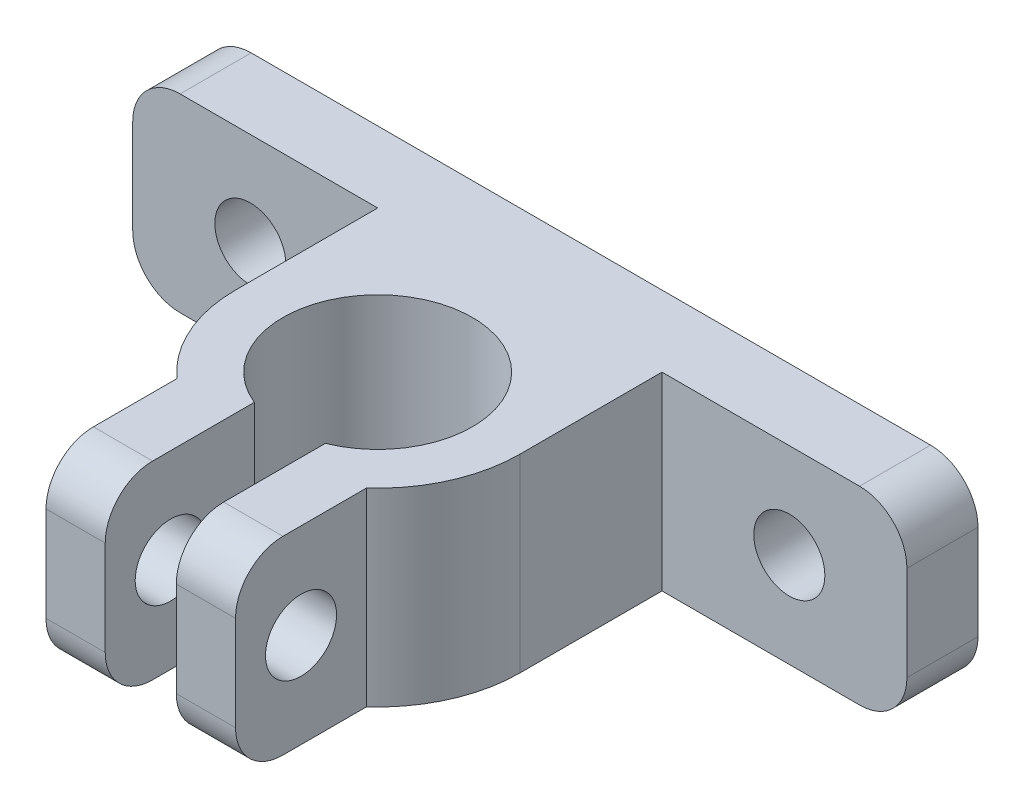
ISO-10303-21;
HEADER;
FILE_DESCRIPTION(('STEP AP214'),'2;1');
FILE_NAME('part.step','',(''),(''),'','','');
FILE_SCHEMA(('AUTOMOTIVE_DESIGN { 1 0 10303 214 1 1 1 1 }'));
ENDSEC;
DATA;
#1=APPLICATION_CONTEXT('core data for automotive mechanical design processes');
#2=APPLICATION_PROTOCOL_DEFINITION('international standard','automotive_design',2000,#1);
#3=PRODUCT_CONTEXT('',#1,'mechanical');
#4=PRODUCT('Part','Part','',(#3));
#5=PRODUCT_RELATED_PRODUCT_CATEGORY('part','',(#4));
#6=PRODUCT_DEFINITION_FORMATION('','',#4);
#7=PRODUCT_DEFINITION_CONTEXT('part definition',#1,'design');
#8=PRODUCT_DEFINITION('design','',#6,#7);
#9=PRODUCT_DEFINITION_SHAPE('','',#8);
#10=(LENGTH_UNIT() NAMED_UNIT(*) SI_UNIT(.MILLI.,.METRE.));
#11=(NAMED_UNIT(*) PLANE_ANGLE_UNIT() SI_UNIT($,.RADIAN.));
#12=(NAMED_UNIT(*) SI_UNIT($,.STERADIAN.) SOLID_ANGLE_UNIT());
#13=UNCERTAINTY_MEASURE_WITH_UNIT(LENGTH_MEASURE(1.E-05),#10,'distance_accuracy_value','');
#14=(GEOMETRIC_REPRESENTATION_CONTEXT(3) GLOBAL_UNCERTAINTY_ASSIGNED_CONTEXT((#13)) GLOBAL_UNIT_ASSIGNED_CONTEXT((#10,
#11,#12)) REPRESENTATION_CONTEXT('',''));
#15=CARTESIAN_POINT('',(0.,0.,0.));
#16=DIRECTION('',(0.,0.,1.));
#17=DIRECTION('',(1.,0.,0.));
#18=AXIS2_PLACEMENT_3D('',#15,#16,#17);
#19=CARTESIAN_POINT('',(0.273302646720342,40.358574689139,16.));
#20=DIRECTION('',(0.,0.,1.));
#21=DIRECTION('',(1.,0.,0.));
#22=AXIS2_PLACEMENT_3D('',#19,#20,#21);
#23=PLANE('',#22);
#24=DIRECTION('',(0.,1.,0.));
#25=VECTOR('',#24,1.);
#26=CARTESIAN_POINT('',(-2.22669735327965,40.358574689139,16.));
#27=LINE('',#26,#25);
#28=CARTESIAN_POINT('',(-2.22669735327965,24.358574689139,16.));
#29=VERTEX_POINT('',#28);
#30=CARTESIAN_POINT('',(-2.22669735327965,28.358574689139,16.));
#31=VERTEX_POINT('',#30);
#32=EDGE_CURVE('E313',#29,#31,#27,.T.);
#33=ORIENTED_EDGE('',*,*,#32,.F.);
#34=DIRECTION('',(-1.,0.,0.));
#35=VECTOR('',#34,1.);
#36=CARTESIAN_POINT('',(0.273302646720342,24.358574689139,16.));
#37=LINE('',#36,#35);
#38=CARTESIAN_POINT('',(0.273302646720342,24.358574689139,16.));
#39=VERTEX_POINT('',#38);
#40=EDGE_CURVE('E68',#29,#39,#37,.F.);
#41=ORIENTED_EDGE('',*,*,#40,.T.);
#42=DIRECTION('',(0.,-1.,0.));
#43=VECTOR('',#42,1.);
#44=CARTESIAN_POINT('',(0.273302646720342,40.358574689139,16.));
#45=LINE('',#44,#43);
#46=CARTESIAN_POINT('',(0.273302646720342,28.358574689139,16.));
#47=VERTEX_POINT('',#46);
#48=EDGE_CURVE('E386',#47,#39,#45,.T.);
#49=ORIENTED_EDGE('',*,*,#48,.F.);
#50=DIRECTION('',(-1.,0.,0.));
#51=VECTOR('',#50,1.);
#52=CARTESIAN_POINT('',(0.273302646720344,28.358574689139,16.));
#53=LINE('',#52,#51);
#54=EDGE_CURVE('E382',#47,#31,#53,.T.);
#55=ORIENTED_EDGE('',*,*,#54,.T.);
#56=EDGE_LOOP('',(#33,#41,#49,#55));
#57=FACE_BOUND('',#56,.T.);
#58=ADVANCED_FACE('F53',(#57),#23,.T.);
#59=CARTESIAN_POINT('',(-3.72669735327962,47.3291374376162,6.));
#60=DIRECTION('',(0.,-1.,0.));
#61=DIRECTION('',(0.,0.,-1.));
#62=AXIS2_PLACEMENT_3D('',#59,#60,#61);
#63=CYLINDRICAL_SURFACE('',#62,6.);
#64=DIRECTION('',(0.,-1.,0.));
#65=VECTOR('',#64,1.);
#66=CARTESIAN_POINT('',(-7.72669735327966,47.3291374376162,10.4721359549995));
#67=LINE('',#66,#65);
#68=CARTESIAN_POINT('',(-7.72669735327966,30.358574689139,10.4721359549995));
#69=VERTEX_POINT('',#68);
#70=CARTESIAN_POINT('',(-7.72669735327966,22.358574689139,10.4721359549995));
#71=VERTEX_POINT('',#70);
#72=EDGE_CURVE('E307',#69,#71,#67,.T.);
#73=ORIENTED_EDGE('',*,*,#72,.F.);
#74=CARTESIAN_POINT('',(-3.72669735327962,30.358574689139,6.));
#75=DIRECTION('',(0.,1.,0.));
#76=DIRECTION('',(-1.,0.,0.));
#77=AXIS2_PLACEMENT_3D('',#74,#75,#76);
#78=CIRCLE('',#77,6.);
#79=CARTESIAN_POINT('',(-9.72669735327963,30.358574689139,6.));
#80=VERTEX_POINT('',#79);
#81=EDGE_CURVE('E254',#69,#80,#78,.F.);
#82=ORIENTED_EDGE('',*,*,#81,.T.);
#83=DIRECTION('',(0.,-1.,0.));
#84=VECTOR('',#83,1.);
#85=CARTESIAN_POINT('',(-9.72669735327963,38.8438560633776,6.));
#86=LINE('',#85,#84);
#87=CARTESIAN_POINT('',(-9.72669735327963,22.358574689139,6.));
#88=VERTEX_POINT('',#87);
#89=EDGE_CURVE('E248',#80,#88,#86,.T.);
#90=ORIENTED_EDGE('',*,*,#89,.T.);
#91=CARTESIAN_POINT('',(-3.72669735327962,22.358574689139,6.));
#92=DIRECTION('',(0.,-1.,0.));
#93=DIRECTION('',(0.,0.,-1.));
#94=AXIS2_PLACEMENT_3D('',#91,#92,#93);
#95=CIRCLE('',#94,6.);
#96=EDGE_CURVE('E245',#71,#88,#95,.T.);
#97=ORIENTED_EDGE('',*,*,#96,.F.);
#98=EDGE_LOOP('',(#73,#82,#90,#97));
#99=FACE_BOUND('',#98,.T.);
#100=ADVANCED_FACE('F505',(#99),#63,.T.);
#101=CARTESIAN_POINT('',(0.,0.,0.));
#102=DIRECTION('',(0.,0.,1.));
#103=DIRECTION('',(1.,0.,0.));
#104=AXIS2_PLACEMENT_3D('',#101,#102,#103);
#105=PLANE('',#104);
#106=CARTESIAN_POINT('',(7.64830264672038,26.358574689139,0.));
#107=DIRECTION('',(0.,0.,1.));
#108=DIRECTION('',(1.,0.,0.));
#109=AXIS2_PLACEMENT_3D('',#106,#107,#108);
#110=CIRCLE('',#109,1.5);
#111=CARTESIAN_POINT('',(9.14830264672038,26.358574689139,0.));
#112=VERTEX_POINT('',#111);
#113=EDGE_CURVE('E265',#112,#112,#110,.T.);
#114=ORIENTED_EDGE('',*,*,#113,.F.);
#115=EDGE_LOOP('',(#114));
#116=FACE_BOUND('',#115,.T.);
#117=DIRECTION('',(1.,0.,0.));
#118=VECTOR('',#117,1.);
#119=CARTESIAN_POINT('',(-20.0653915042754,22.358574689139,0.));
#120=LINE('',#119,#118);
#121=CARTESIAN_POINT('',(2.27330264672038,22.358574689139,0.));
#122=VERTEX_POINT('',#121);
#123=CARTESIAN_POINT('',(10.6119967977161,22.358574689139,0.));
#124=VERTEX_POINT('',#123);
#125=EDGE_CURVE('E303',#122,#124,#120,.T.);
#126=ORIENTED_EDGE('',*,*,#125,.T.);
#127=CARTESIAN_POINT('',(10.6119967977161,24.358574689139,0.));
#128=DIRECTION('',(0.,0.,1.));
#129=DIRECTION('',(1.,0.,0.));
#130=AXIS2_PLACEMENT_3D('',#127,#128,#129);
#131=CIRCLE('',#130,2.);
#132=CARTESIAN_POINT('',(12.6119967977161,24.358574689139,0.));
#133=VERTEX_POINT('',#132);
#134=EDGE_CURVE('E328',#124,#133,#131,.T.);
#135=ORIENTED_EDGE('',*,*,#134,.T.);
#136=DIRECTION('',(0.,1.,0.));
#137=VECTOR('',#136,1.);
#138=CARTESIAN_POINT('',(12.6119967977161,30.358574689139,0.));
#139=LINE('',#138,#137);
#140=CARTESIAN_POINT('',(12.6119967977161,28.358574689139,0.));
#141=VERTEX_POINT('',#140);
#142=EDGE_CURVE('E272',#133,#141,#139,.T.);
#143=ORIENTED_EDGE('',*,*,#142,.T.);
#144=CARTESIAN_POINT('',(10.6119967977161,28.358574689139,0.));
#145=DIRECTION('',(0.,0.,1.));
#146=DIRECTION('',(1.,0.,0.));
#147=AXIS2_PLACEMENT_3D('',#144,#145,#146);
#148=CIRCLE('',#147,2.);
#149=CARTESIAN_POINT('',(10.6119967977161,30.358574689139,0.));
#150=VERTEX_POINT('',#149);
#151=EDGE_CURVE('E326',#141,#150,#148,.T.);
#152=ORIENTED_EDGE('',*,*,#151,.T.);
#153=DIRECTION('',(-1.,0.,0.));
#154=VECTOR('',#153,1.);
#155=CARTESIAN_POINT('',(-20.0653915042754,30.358574689139,0.));
#156=LINE('',#155,#154);
#157=CARTESIAN_POINT('',(2.27330264672038,30.358574689139,0.));
#158=VERTEX_POINT('',#157);
#159=EDGE_CURVE('E298',#150,#158,#156,.T.);
#160=ORIENTED_EDGE('',*,*,#159,.T.);
#161=DIRECTION('',(0.,-1.,0.));
#162=VECTOR('',#161,1.);
#163=CARTESIAN_POINT('',(2.27330264672038,38.8438560633776,0.));
#164=LINE('',#163,#162);
#165=EDGE_CURVE('E257',#158,#122,#164,.T.);
#166=ORIENTED_EDGE('',*,*,#165,.T.);
#167=EDGE_LOOP('',(#126,#135,#143,#152,#160,#166));
#168=FACE_BOUND('',#167,.T.);
#169=ADVANCED_FACE('F464',(#116,#168),#105,.T.);
#170=CARTESIAN_POINT('',(12.6119967977161,30.358574689139,-3.));
#171=DIRECTION('',(1.,0.,0.));
#172=DIRECTION('',(0.,1.,0.));
#173=AXIS2_PLACEMENT_3D('',#170,#171,#172);
#174=PLANE('',#173);
#175=ORIENTED_EDGE('',*,*,#142,.F.);
#176=DIRECTION('',(0.,0.,1.));
#177=VECTOR('',#176,1.);
#178=CARTESIAN_POINT('',(12.6119967977161,24.358574689139,-3.));
#179=LINE('',#178,#177);
#180=CARTESIAN_POINT('',(12.6119967977161,24.358574689139,-3.));
#181=VERTEX_POINT('',#180);
#182=EDGE_CURVE('E333',#133,#181,#179,.F.);
#183=ORIENTED_EDGE('',*,*,#182,.T.);
#184=DIRECTION('',(0.,1.,0.));
#185=VECTOR('',#184,1.);
#186=CARTESIAN_POINT('',(12.6119967977161,30.358574689139,-3.));
#187=LINE('',#186,#185);
#188=CARTESIAN_POINT('',(12.6119967977161,28.358574689139,-3.));
#189=VERTEX_POINT('',#188);
#190=EDGE_CURVE('E281',#181,#189,#187,.T.);
#191=ORIENTED_EDGE('',*,*,#190,.T.);
#192=DIRECTION('',(0.,0.,1.));
#193=VECTOR('',#192,1.);
#194=CARTESIAN_POINT('',(12.6119967977161,28.358574689139,-3.));
#195=LINE('',#194,#193);
#196=EDGE_CURVE('E330',#189,#141,#195,.T.);
#197=ORIENTED_EDGE('',*,*,#196,.T.);
#198=EDGE_LOOP('',(#175,#183,#191,#197));
#199=FACE_BOUND('',#198,.T.);
#200=ADVANCED_FACE('F456',(#199),#174,.T.);
#201=CARTESIAN_POINT('',(-20.0653915042754,22.358574689139,-3.));
#202=DIRECTION('',(0.,-1.,0.));
#203=DIRECTION('',(0.,0.,-1.));
#204=AXIS2_PLACEMENT_3D('',#201,#202,#203);
#205=PLANE('',#204);
#206=DIRECTION('',(0.,0.,-1.));
#207=VECTOR('',#206,1.);
#208=CARTESIAN_POINT('',(-5.22669735327965,22.358574689139,6.));
#209=LINE('',#208,#207);
#210=CARTESIAN_POINT('',(-5.22669735327965,22.358574689139,14.));
#211=VERTEX_POINT('',#210);
#212=CARTESIAN_POINT('',(-5.22669735327965,22.358574689139,9.70809924354782));
#213=VERTEX_POINT('',#212);
#214=EDGE_CURVE('E236',#211,#213,#209,.T.);
#215=ORIENTED_EDGE('',*,*,#214,.F.);
#216=DIRECTION('',(-1.,0.,0.));
#217=VECTOR('',#216,1.);
#218=CARTESIAN_POINT('',(-20.0653915042754,22.358574689139,14.));
#219=LINE('',#218,#217);
#220=CARTESIAN_POINT('',(-7.72669735327966,22.358574689139,14.));
#221=VERTEX_POINT('',#220);
#222=EDGE_CURVE('E375',#211,#221,#219,.T.);
#223=ORIENTED_EDGE('',*,*,#222,.T.);
#224=DIRECTION('',(0.,0.,-1.));
#225=VECTOR('',#224,1.);
#226=CARTESIAN_POINT('',(-7.72669735327966,22.358574689139,10.));
#227=LINE('',#226,#225);
#228=EDGE_CURVE('E394',#221,#71,#227,.T.);
#229=ORIENTED_EDGE('',*,*,#228,.T.);
#230=ORIENTED_EDGE('',*,*,#96,.T.);
#231=DIRECTION('',(0.,0.,-1.));
#232=VECTOR('',#231,1.);
#233=CARTESIAN_POINT('',(-9.72669735327963,22.358574689139,6.));
#234=LINE('',#233,#232);
#235=CARTESIAN_POINT('',(-9.72669735327963,22.358574689139,0.));
#236=VERTEX_POINT('',#235);
#237=EDGE_CURVE('E243',#88,#236,#234,.T.);
#238=ORIENTED_EDGE('',*,*,#237,.T.);
#239=CARTESIAN_POINT('',(-18.0653915042754,22.358574689139,0.));
#240=VERTEX_POINT('',#239);
#241=EDGE_CURVE('E285',#240,#236,#120,.T.);
#242=ORIENTED_EDGE('',*,*,#241,.F.);
#243=DIRECTION('',(0.,0.,1.));
#244=VECTOR('',#243,1.);
#245=CARTESIAN_POINT('',(-18.0653915042754,22.358574689139,-3.));
#246=LINE('',#245,#244);
#247=CARTESIAN_POINT('',(-18.0653915042754,22.358574689139,-3.));
#248=VERTEX_POINT('',#247);
#249=EDGE_CURVE('E316',#240,#248,#246,.F.);
#250=ORIENTED_EDGE('',*,*,#249,.T.);
#251=DIRECTION('',(1.,0.,0.));
#252=VECTOR('',#251,1.);
#253=CARTESIAN_POINT('',(-20.0653915042754,22.358574689139,-3.));
#254=LINE('',#253,#252);
#255=CARTESIAN_POINT('',(10.6119967977161,22.358574689139,-3.));
#256=VERTEX_POINT('',#255);
#257=EDGE_CURVE('E291',#248,#256,#254,.T.);
#258=ORIENTED_EDGE('',*,*,#257,.T.);
#259=DIRECTION('',(0.,0.,1.));
#260=VECTOR('',#259,1.);
#261=CARTESIAN_POINT('',(10.6119967977161,22.358574689139,-3.));
#262=LINE('',#261,#260);
#263=EDGE_CURVE('E323',#256,#124,#262,.T.);
#264=ORIENTED_EDGE('',*,*,#263,.T.);
#265=ORIENTED_EDGE('',*,*,#125,.F.);
#266=DIRECTION('',(0.,0.,-1.));
#267=VECTOR('',#266,1.);
#268=CARTESIAN_POINT('',(2.27330264672038,22.358574689139,6.));
#269=LINE('',#268,#267);
#270=CARTESIAN_POINT('',(2.27330264672038,22.358574689139,6.));
#271=VERTEX_POINT('',#270);
#272=EDGE_CURVE('E258',#271,#122,#269,.T.);
#273=ORIENTED_EDGE('',*,*,#272,.F.);
#274=CARTESIAN_POINT('',(0.273302646720341,22.358574689139,10.4721359549996));
#275=VERTEX_POINT('',#274);
#276=EDGE_CURVE('E251',#271,#275,#95,.T.);
#277=ORIENTED_EDGE('',*,*,#276,.T.);
#278=DIRECTION('',(0.,0.,1.));
#279=VECTOR('',#278,1.);
#280=CARTESIAN_POINT('',(0.273302646720342,22.358574689139,10.));
#281=LINE('',#280,#279);
#282=CARTESIAN_POINT('',(0.273302646720342,22.358574689139,14.));
#283=VERTEX_POINT('',#282);
#284=EDGE_CURVE('E224',#275,#283,#281,.T.);
#285=ORIENTED_EDGE('',*,*,#284,.T.);
#286=DIRECTION('',(-1.,0.,0.));
#287=VECTOR('',#286,1.);
#288=CARTESIAN_POINT('',(-20.0653915042754,22.358574689139,14.));
#289=LINE('',#288,#287);
#290=CARTESIAN_POINT('',(-2.22669735327964,22.358574689139,14.));
#291=VERTEX_POINT('',#290);
#292=EDGE_CURVE('E235',#283,#291,#289,.T.);
#293=ORIENTED_EDGE('',*,*,#292,.T.);
#294=DIRECTION('',(0.,0.,1.));
#295=VECTOR('',#294,1.);
#296=CARTESIAN_POINT('',(-2.2266973532796,22.358574689139,6.));
#297=LINE('',#296,#295);
#298=CARTESIAN_POINT('',(-2.22669735327962,22.358574689139,9.70809924354783));
#299=VERTEX_POINT('',#298);
#300=EDGE_CURVE('E217',#299,#291,#297,.T.);
#301=ORIENTED_EDGE('',*,*,#300,.F.);
#302=CARTESIAN_POINT('',(-3.72669735327962,22.358574689139,6.));
#303=DIRECTION('',(0.,-1.,0.));
#304=DIRECTION('',(0.,0.,-1.));
#305=AXIS2_PLACEMENT_3D('',#302,#303,#304);
#306=CIRCLE('',#305,4.);
#307=EDGE_CURVE('E232',#213,#299,#306,.T.);
#308=ORIENTED_EDGE('',*,*,#307,.F.);
#309=EDGE_LOOP('',(#215,#223,#229,#230,#238,#242,#250,#258,#264,#265,#273,#277,#285,#293,#301,#308));
#310=FACE_BOUND('',#309,.T.);
#311=ADVANCED_FACE('F231',(#310),#205,.T.);
#312=CARTESIAN_POINT('',(-20.0653915042754,30.358574689139,-3.));
#313=DIRECTION('',(-1.,0.,0.));
#314=DIRECTION('',(0.,0.,1.));
#315=AXIS2_PLACEMENT_3D('',#312,#313,#314);
#316=PLANE('',#315);
#317=DIRECTION('',(0.,-1.,0.));
#318=VECTOR('',#317,1.);
#319=CARTESIAN_POINT('',(-20.0653915042754,30.358574689139,-3.));
#320=LINE('',#319,#318);
#321=CARTESIAN_POINT('',(-20.0653915042754,28.358574689139,-3.));
#322=VERTEX_POINT('',#321);
#323=CARTESIAN_POINT('',(-20.0653915042754,24.358574689139,-3.));
#324=VERTEX_POINT('',#323);
#325=EDGE_CURVE('E288',#322,#324,#320,.T.);
#326=ORIENTED_EDGE('',*,*,#325,.T.);
#327=DIRECTION('',(0.,0.,1.));
#328=VECTOR('',#327,1.);
#329=CARTESIAN_POINT('',(-20.0653915042754,24.358574689139,-3.));
#330=LINE('',#329,#328);
#331=CARTESIAN_POINT('',(-20.0653915042754,24.358574689139,0.));
#332=VERTEX_POINT('',#331);
#333=EDGE_CURVE('E350',#324,#332,#330,.T.);
#334=ORIENTED_EDGE('',*,*,#333,.T.);
#335=DIRECTION('',(0.,-1.,0.));
#336=VECTOR('',#335,1.);
#337=CARTESIAN_POINT('',(-20.0653915042754,30.358574689139,0.));
#338=LINE('',#337,#336);
#339=CARTESIAN_POINT('',(-20.0653915042754,28.358574689139,0.));
#340=VERTEX_POINT('',#339);
#341=EDGE_CURVE('E300',#340,#332,#338,.T.);
#342=ORIENTED_EDGE('',*,*,#341,.F.);
#343=DIRECTION('',(0.,0.,1.));
#344=VECTOR('',#343,1.);
#345=CARTESIAN_POINT('',(-20.0653915042754,28.358574689139,-3.));
#346=LINE('',#345,#344);
#347=EDGE_CURVE('E348',#340,#322,#346,.F.);
#348=ORIENTED_EDGE('',*,*,#347,.T.);
#349=EDGE_LOOP('',(#326,#334,#342,#348));
#350=FACE_BOUND('',#349,.T.);
#351=ADVANCED_FACE('F442',(#350),#316,.T.);
#352=CARTESIAN_POINT('',(-20.0653915042754,30.358574689139,-3.));
#353=DIRECTION('',(0.,1.,0.));
#354=DIRECTION('',(-1.,0.,0.));
#355=AXIS2_PLACEMENT_3D('',#352,#353,#354);
#356=PLANE('',#355);
#357=DIRECTION('',(0.,0.,-1.));
#358=VECTOR('',#357,1.);
#359=CARTESIAN_POINT('',(-7.72669735327966,30.358574689139,10.));
#360=LINE('',#359,#358);
#361=CARTESIAN_POINT('',(-7.72669735327966,30.358574689139,14.));
#362=VERTEX_POINT('',#361);
#363=EDGE_CURVE('E401',#362,#69,#360,.T.);
#364=ORIENTED_EDGE('',*,*,#363,.F.);
#365=DIRECTION('',(-1.,0.,0.));
#366=VECTOR('',#365,1.);
#367=CARTESIAN_POINT('',(-20.0653915042754,30.358574689139,14.));
#368=LINE('',#367,#366);
#369=CARTESIAN_POINT('',(-5.22669735327965,30.358574689139,14.));
#370=VERTEX_POINT('',#369);
#371=EDGE_CURVE('E368',#362,#370,#368,.F.);
#372=ORIENTED_EDGE('',*,*,#371,.T.);
#373=DIRECTION('',(0.,0.,-1.));
#374=VECTOR('',#373,1.);
#375=CARTESIAN_POINT('',(-5.22669735327965,30.358574689139,6.));
#376=LINE('',#375,#374);
#377=CARTESIAN_POINT('',(-5.22669735327965,30.358574689139,9.70809924354782));
#378=VERTEX_POINT('',#377);
#379=EDGE_CURVE('E474',#370,#378,#376,.T.);
#380=ORIENTED_EDGE('',*,*,#379,.T.);
#381=CARTESIAN_POINT('',(-3.72669735327962,30.358574689139,6.));
#382=DIRECTION('',(0.,-1.,0.));
#383=DIRECTION('',(0.,0.,-1.));
#384=AXIS2_PLACEMENT_3D('',#381,#382,#383);
#385=CIRCLE('',#384,4.);
#386=CARTESIAN_POINT('',(-2.22669735327962,30.358574689139,9.70809924354783));
#387=VERTEX_POINT('',#386);
#388=EDGE_CURVE('E242',#378,#387,#385,.T.);
#389=ORIENTED_EDGE('',*,*,#388,.T.);
#390=DIRECTION('',(0.,0.,1.));
#391=VECTOR('',#390,1.);
#392=CARTESIAN_POINT('',(-2.2266973532796,30.358574689139,6.));
#393=LINE('',#392,#391);
#394=CARTESIAN_POINT('',(-2.22669735327964,30.358574689139,14.));
#395=VERTEX_POINT('',#394);
#396=EDGE_CURVE('E219',#387,#395,#393,.T.);
#397=ORIENTED_EDGE('',*,*,#396,.T.);
#398=DIRECTION('',(-1.,0.,0.));
#399=VECTOR('',#398,1.);
#400=CARTESIAN_POINT('',(-20.0653915042754,30.358574689139,14.));
#401=LINE('',#400,#399);
#402=CARTESIAN_POINT('',(0.273302646720342,30.358574689139,14.));
#403=VERTEX_POINT('',#402);
#404=EDGE_CURVE('E366',#395,#403,#401,.F.);
#405=ORIENTED_EDGE('',*,*,#404,.T.);
#406=DIRECTION('',(0.,0.,1.));
#407=VECTOR('',#406,1.);
#408=CARTESIAN_POINT('',(0.273302646720342,30.358574689139,10.));
#409=LINE('',#408,#407);
#410=CARTESIAN_POINT('',(0.273302646720342,30.358574689139,10.4721359549996));
#411=VERTEX_POINT('',#410);
#412=EDGE_CURVE('E399',#411,#403,#409,.T.);
#413=ORIENTED_EDGE('',*,*,#412,.F.);
#414=CARTESIAN_POINT('',(2.27330264672038,30.358574689139,6.));
#415=VERTEX_POINT('',#414);
#416=EDGE_CURVE('E255',#415,#411,#78,.F.);
#417=ORIENTED_EDGE('',*,*,#416,.F.);
#418=DIRECTION('',(0.,0.,-1.));
#419=VECTOR('',#418,1.);
#420=CARTESIAN_POINT('',(2.27330264672038,30.358574689139,6.));
#421=LINE('',#420,#419);
#422=EDGE_CURVE('E261',#415,#158,#421,.T.);
#423=ORIENTED_EDGE('',*,*,#422,.T.);
#424=ORIENTED_EDGE('',*,*,#159,.F.);
#425=DIRECTION('',(0.,0.,1.));
#426=VECTOR('',#425,1.);
#427=CARTESIAN_POINT('',(10.6119967977161,30.358574689139,-3.));
#428=LINE('',#427,#426);
#429=CARTESIAN_POINT('',(10.6119967977161,30.358574689139,-3.));
#430=VERTEX_POINT('',#429);
#431=EDGE_CURVE('E346',#150,#430,#428,.F.);
#432=ORIENTED_EDGE('',*,*,#431,.T.);
#433=DIRECTION('',(-1.,0.,0.));
#434=VECTOR('',#433,1.);
#435=CARTESIAN_POINT('',(-20.0653915042754,30.358574689139,-3.));
#436=LINE('',#435,#434);
#437=CARTESIAN_POINT('',(-18.0653915042754,30.358574689139,-3.));
#438=VERTEX_POINT('',#437);
#439=EDGE_CURVE('E284',#430,#438,#436,.T.);
#440=ORIENTED_EDGE('',*,*,#439,.T.);
#441=DIRECTION('',(0.,0.,1.));
#442=VECTOR('',#441,1.);
#443=CARTESIAN_POINT('',(-18.0653915042754,30.358574689139,-3.));
#444=LINE('',#443,#442);
#445=CARTESIAN_POINT('',(-18.0653915042754,30.358574689139,0.));
#446=VERTEX_POINT('',#445);
#447=EDGE_CURVE('E343',#438,#446,#444,.T.);
#448=ORIENTED_EDGE('',*,*,#447,.T.);
#449=CARTESIAN_POINT('',(-9.72669735327963,30.358574689139,0.));
#450=VERTEX_POINT('',#449);
#451=EDGE_CURVE('E297',#450,#446,#156,.T.);
#452=ORIENTED_EDGE('',*,*,#451,.F.);
#453=DIRECTION('',(0.,0.,-1.));
#454=VECTOR('',#453,1.);
#455=CARTESIAN_POINT('',(-9.72669735327963,30.358574689139,6.));
#456=LINE('',#455,#454);
#457=EDGE_CURVE('E409',#80,#450,#456,.T.);
#458=ORIENTED_EDGE('',*,*,#457,.F.);
#459=ORIENTED_EDGE('',*,*,#81,.F.);
#460=EDGE_LOOP('',(#364,#372,#380,#389,#397,#405,#413,#417,#423,#424,#432,#440,#448,#452,#458,#459));
#461=FACE_BOUND('',#460,.T.);
#462=ADVANCED_FACE('F422',(#461),#356,.T.);
#463=CARTESIAN_POINT('',(0.,0.,-3.));
#464=DIRECTION('',(0.,0.,1.));
#465=DIRECTION('',(1.,0.,0.));
#466=AXIS2_PLACEMENT_3D('',#463,#464,#465);
#467=PLANE('',#466);
#468=CARTESIAN_POINT('',(-15.1016973532796,26.358574689139,-3.));
#469=DIRECTION('',(0.,0.,1.));
#470=DIRECTION('',(1.,0.,0.));
#471=AXIS2_PLACEMENT_3D('',#468,#469,#470);
#472=CIRCLE('',#471,1.5);
#473=CARTESIAN_POINT('',(-13.6016973532796,26.358574689139,-3.));
#474=VERTEX_POINT('',#473);
#475=EDGE_CURVE('E269',#474,#474,#472,.T.);
#476=ORIENTED_EDGE('',*,*,#475,.T.);
#477=EDGE_LOOP('',(#476));
#478=FACE_BOUND('',#477,.T.);
#479=CARTESIAN_POINT('',(7.64830264672038,26.358574689139,-3.));
#480=DIRECTION('',(0.,0.,1.));
#481=DIRECTION('',(1.,0.,0.));
#482=AXIS2_PLACEMENT_3D('',#479,#480,#481);
#483=CIRCLE('',#482,1.5);
#484=CARTESIAN_POINT('',(9.14830264672038,26.358574689139,-3.));
#485=VERTEX_POINT('',#484);
#486=EDGE_CURVE('E276',#485,#485,#483,.T.);
#487=ORIENTED_EDGE('',*,*,#486,.T.);
#488=EDGE_LOOP('',(#487));
#489=FACE_BOUND('',#488,.T.);
#490=ORIENTED_EDGE('',*,*,#190,.F.);
#491=CARTESIAN_POINT('',(10.6119967977161,24.358574689139,-3.));
#492=DIRECTION('',(0.,0.,1.));
#493=DIRECTION('',(1.,0.,0.));
#494=AXIS2_PLACEMENT_3D('',#491,#492,#493);
#495=CIRCLE('',#494,2.);
#496=EDGE_CURVE('E341',#181,#256,#495,.F.);
#497=ORIENTED_EDGE('',*,*,#496,.T.);
#498=ORIENTED_EDGE('',*,*,#257,.F.);
#499=CARTESIAN_POINT('',(-18.0653915042754,24.358574689139,-3.));
#500=DIRECTION('',(0.,0.,1.));
#501=DIRECTION('',(1.,0.,0.));
#502=AXIS2_PLACEMENT_3D('',#499,#500,#501);
#503=CIRCLE('',#502,2.);
#504=EDGE_CURVE('E337',#248,#324,#503,.F.);
#505=ORIENTED_EDGE('',*,*,#504,.T.);
#506=ORIENTED_EDGE('',*,*,#325,.F.);
#507=CARTESIAN_POINT('',(-18.0653915042754,28.358574689139,-3.));
#508=DIRECTION('',(0.,0.,1.));
#509=DIRECTION('',(1.,0.,0.));
#510=AXIS2_PLACEMENT_3D('',#507,#508,#509);
#511=CIRCLE('',#510,2.);
#512=EDGE_CURVE('E335',#322,#438,#511,.F.);
#513=ORIENTED_EDGE('',*,*,#512,.T.);
#514=ORIENTED_EDGE('',*,*,#439,.F.);
#515=CARTESIAN_POINT('',(10.6119967977161,28.358574689139,-3.));
#516=DIRECTION('',(0.,0.,1.));
#517=DIRECTION('',(1.,0.,0.));
#518=AXIS2_PLACEMENT_3D('',#515,#516,#517);
#519=CIRCLE('',#518,2.);
#520=EDGE_CURVE('E339',#430,#189,#519,.F.);
#521=ORIENTED_EDGE('',*,*,#520,.T.);
#522=EDGE_LOOP('',(#490,#497,#498,#505,#506,#513,#514,#521));
#523=FACE_BOUND('',#522,.T.);
#524=ADVANCED_FACE('F439',(#478,#489,#523),#467,.F.);
#525=ORIENTED_EDGE('',*,*,#341,.T.);
#526=CARTESIAN_POINT('',(-18.0653915042754,24.358574689139,0.));
#527=DIRECTION('',(0.,0.,1.));
#528=DIRECTION('',(1.,0.,0.));
#529=AXIS2_PLACEMENT_3D('',#526,#527,#528);
#530=CIRCLE('',#529,2.);
#531=EDGE_CURVE('E355',#332,#240,#530,.T.);
#532=ORIENTED_EDGE('',*,*,#531,.T.);
#533=ORIENTED_EDGE('',*,*,#241,.T.);
#534=DIRECTION('',(0.,-1.,0.));
#535=VECTOR('',#534,1.);
#536=CARTESIAN_POINT('',(-9.72669735327963,38.8438560633776,0.));
#537=LINE('',#536,#535);
#538=EDGE_CURVE('E406',#450,#236,#537,.T.);
#539=ORIENTED_EDGE('',*,*,#538,.F.);
#540=ORIENTED_EDGE('',*,*,#451,.T.);
#541=CARTESIAN_POINT('',(-18.0653915042754,28.358574689139,0.));
#542=DIRECTION('',(0.,0.,1.));
#543=DIRECTION('',(1.,0.,0.));
#544=AXIS2_PLACEMENT_3D('',#541,#542,#543);
#545=CIRCLE('',#544,2.);
#546=EDGE_CURVE('E353',#446,#340,#545,.T.);
#547=ORIENTED_EDGE('',*,*,#546,.T.);
#548=EDGE_LOOP('',(#525,#532,#533,#539,#540,#547));
#549=FACE_BOUND('',#548,.T.);
#550=CARTESIAN_POINT('',(-15.1016973532796,26.358574689139,0.));
#551=DIRECTION('',(0.,0.,1.));
#552=DIRECTION('',(1.,0.,0.));
#553=AXIS2_PLACEMENT_3D('',#550,#551,#552);
#554=CIRCLE('',#553,1.5);
#555=CARTESIAN_POINT('',(-13.6016973532796,26.358574689139,0.));
#556=VERTEX_POINT('',#555);
#557=EDGE_CURVE('E273',#556,#556,#554,.T.);
#558=ORIENTED_EDGE('',*,*,#557,.F.);
#559=EDGE_LOOP('',(#558));
#560=FACE_BOUND('',#559,.T.);
#561=ADVANCED_FACE('F426',(#549,#560),#105,.T.);
#562=CARTESIAN_POINT('',(7.64830264672038,26.358574689139,-3.));
#563=DIRECTION('',(0.,0.,1.));
#564=DIRECTION('',(1.,0.,0.));
#565=AXIS2_PLACEMENT_3D('',#562,#563,#564);
#566=CYLINDRICAL_SURFACE('',#565,1.5);
#567=ORIENTED_EDGE('',*,*,#486,.F.);
#568=EDGE_LOOP('',(#567));
#569=FACE_BOUND('',#568,.T.);
#570=ORIENTED_EDGE('',*,*,#113,.T.);
#571=EDGE_LOOP('',(#570));
#572=FACE_BOUND('',#571,.T.);
#573=ADVANCED_FACE('F563',(#569,#572),#566,.F.);
#574=CARTESIAN_POINT('',(-15.1016973532796,26.358574689139,-3.));
#575=DIRECTION('',(0.,0.,1.));
#576=DIRECTION('',(1.,0.,0.));
#577=AXIS2_PLACEMENT_3D('',#574,#575,#576);
#578=CYLINDRICAL_SURFACE('',#577,1.5);
#579=ORIENTED_EDGE('',*,*,#475,.F.);
#580=EDGE_LOOP('',(#579));
#581=FACE_BOUND('',#580,.T.);
#582=ORIENTED_EDGE('',*,*,#557,.T.);
#583=EDGE_LOOP('',(#582));
#584=FACE_BOUND('',#583,.T.);
#585=ADVANCED_FACE('F569',(#581,#584),#578,.F.);
#586=CARTESIAN_POINT('',(2.27330264672038,38.8438560633776,6.));
#587=DIRECTION('',(-1.,0.,0.));
#588=DIRECTION('',(0.,0.,1.));
#589=AXIS2_PLACEMENT_3D('',#586,#587,#588);
#590=PLANE('',#589);
#591=ORIENTED_EDGE('',*,*,#422,.F.);
#592=DIRECTION('',(0.,-1.,0.));
#593=VECTOR('',#592,1.);
#594=CARTESIAN_POINT('',(2.27330264672038,38.8438560633776,6.));
#595=LINE('',#594,#593);
#596=EDGE_CURVE('E262',#415,#271,#595,.T.);
#597=ORIENTED_EDGE('',*,*,#596,.T.);
#598=ORIENTED_EDGE('',*,*,#272,.T.);
#599=ORIENTED_EDGE('',*,*,#165,.F.);
#600=EDGE_LOOP('',(#591,#597,#598,#599));
#601=FACE_BOUND('',#600,.T.);
#602=ADVANCED_FACE('F468',(#601),#590,.F.);
#603=DIRECTION('',(0.,-1.,0.));
#604=VECTOR('',#603,1.);
#605=CARTESIAN_POINT('',(0.273302646720341,47.3291374376162,10.4721359549996));
#606=LINE('',#605,#604);
#607=EDGE_CURVE('E294',#275,#411,#606,.F.);
#608=ORIENTED_EDGE('',*,*,#607,.F.);
#609=ORIENTED_EDGE('',*,*,#276,.F.);
#610=ORIENTED_EDGE('',*,*,#596,.F.);
#611=ORIENTED_EDGE('',*,*,#416,.T.);
#612=EDGE_LOOP('',(#608,#609,#610,#611));
#613=FACE_BOUND('',#612,.T.);
#614=ADVANCED_FACE('F472',(#613),#63,.T.);
#615=CARTESIAN_POINT('',(-3.72669735327962,30.358574689139,6.));
#616=DIRECTION('',(0.,-1.,0.));
#617=DIRECTION('',(0.,0.,-1.));
#618=AXIS2_PLACEMENT_3D('',#615,#616,#617);
#619=CYLINDRICAL_SURFACE('',#618,4.);
#620=ORIENTED_EDGE('',*,*,#307,.T.);
#621=DIRECTION('',(0.,-1.,0.));
#622=VECTOR('',#621,1.);
#623=CARTESIAN_POINT('',(-2.22669735327962,30.358574689139,9.70809924354783));
#624=LINE('',#623,#622);
#625=EDGE_CURVE('E214',#299,#387,#624,.F.);
#626=ORIENTED_EDGE('',*,*,#625,.T.);
#627=ORIENTED_EDGE('',*,*,#388,.F.);
#628=DIRECTION('',(0.,-1.,0.));
#629=VECTOR('',#628,1.);
#630=CARTESIAN_POINT('',(-5.22669735327965,30.358574689139,9.70809924354782));
#631=LINE('',#630,#629);
#632=EDGE_CURVE('E225',#378,#213,#631,.T.);
#633=ORIENTED_EDGE('',*,*,#632,.T.);
#634=EDGE_LOOP('',(#620,#626,#627,#633));
#635=FACE_BOUND('',#634,.T.);
#636=ADVANCED_FACE('F240',(#635),#619,.F.);
#637=CARTESIAN_POINT('',(-9.72669735327963,38.8438560633776,6.));
#638=DIRECTION('',(-1.,0.,0.));
#639=DIRECTION('',(0.,0.,1.));
#640=AXIS2_PLACEMENT_3D('',#637,#638,#639);
#641=PLANE('',#640);
#642=ORIENTED_EDGE('',*,*,#89,.F.);
#643=ORIENTED_EDGE('',*,*,#457,.T.);
#644=ORIENTED_EDGE('',*,*,#538,.T.);
#645=ORIENTED_EDGE('',*,*,#237,.F.);
#646=EDGE_LOOP('',(#642,#643,#644,#645));
#647=FACE_BOUND('',#646,.T.);
#648=ADVANCED_FACE('F416',(#647),#641,.T.);
#649=DIRECTION('',(0.,-1.,0.));
#650=VECTOR('',#649,1.);
#651=CARTESIAN_POINT('',(-5.22669735327965,40.358574689139,16.));
#652=LINE('',#651,#650);
#653=CARTESIAN_POINT('',(-5.22669735327965,28.358574689139,16.));
#654=VERTEX_POINT('',#653);
#655=CARTESIAN_POINT('',(-5.22669735327965,24.358574689139,16.));
#656=VERTEX_POINT('',#655);
#657=EDGE_CURVE('E310',#654,#656,#652,.T.);
#658=ORIENTED_EDGE('',*,*,#657,.F.);
#659=DIRECTION('',(-1.,0.,0.));
#660=VECTOR('',#659,1.);
#661=CARTESIAN_POINT('',(0.273302646720344,28.358574689139,16.));
#662=LINE('',#661,#660);
#663=CARTESIAN_POINT('',(-7.72669735327966,28.358574689139,16.));
#664=VERTEX_POINT('',#663);
#665=EDGE_CURVE('E359',#654,#664,#662,.T.);
#666=ORIENTED_EDGE('',*,*,#665,.T.);
#667=DIRECTION('',(0.,-1.,0.));
#668=VECTOR('',#667,1.);
#669=CARTESIAN_POINT('',(-7.72669735327966,40.358574689139,16.));
#670=LINE('',#669,#668);
#671=CARTESIAN_POINT('',(-7.72669735327966,24.358574689139,16.));
#672=VERTEX_POINT('',#671);
#673=EDGE_CURVE('E396',#664,#672,#670,.T.);
#674=ORIENTED_EDGE('',*,*,#673,.T.);
#675=DIRECTION('',(-1.,0.,0.));
#676=VECTOR('',#675,1.);
#677=CARTESIAN_POINT('',(0.273302646720342,24.358574689139,16.));
#678=LINE('',#677,#676);
#679=EDGE_CURVE('E357',#672,#656,#678,.F.);
#680=ORIENTED_EDGE('',*,*,#679,.T.);
#681=EDGE_LOOP('',(#658,#666,#674,#680));
#682=FACE_BOUND('',#681,.T.);
#683=ADVANCED_FACE('F500',(#682),#23,.T.);
#684=CARTESIAN_POINT('',(-7.72669735327966,40.358574689139,10.));
#685=DIRECTION('',(-1.,0.,0.));
#686=DIRECTION('',(0.,0.,1.));
#687=AXIS2_PLACEMENT_3D('',#684,#685,#686);
#688=PLANE('',#687);
#689=CARTESIAN_POINT('',(-7.72669735327966,26.358574689139,13.2360679774998));
#690=DIRECTION('',(-1.,0.,0.));
#691=DIRECTION('',(0.,0.,1.));
#692=AXIS2_PLACEMENT_3D('',#689,#690,#691);
#693=CIRCLE('',#692,1.5);
#694=CARTESIAN_POINT('',(-7.72669735327966,26.358574689139,14.7360679774998));
#695=VERTEX_POINT('',#694);
#696=EDGE_CURVE('E237',#695,#695,#693,.T.);
#697=ORIENTED_EDGE('',*,*,#696,.F.);
#698=EDGE_LOOP('',(#697));
#699=FACE_BOUND('',#698,.T.);
#700=ORIENTED_EDGE('',*,*,#673,.F.);
#701=CARTESIAN_POINT('',(-7.72669735327966,28.358574689139,14.));
#702=DIRECTION('',(-1.,0.,0.));
#703=DIRECTION('',(0.,0.,1.));
#704=AXIS2_PLACEMENT_3D('',#701,#702,#703);
#705=CIRCLE('',#704,2.);
#706=EDGE_CURVE('E364',#664,#362,#705,.T.);
#707=ORIENTED_EDGE('',*,*,#706,.T.);
#708=ORIENTED_EDGE('',*,*,#363,.T.);
#709=ORIENTED_EDGE('',*,*,#72,.T.);
#710=ORIENTED_EDGE('',*,*,#228,.F.);
#711=CARTESIAN_POINT('',(-7.72669735327966,24.358574689139,14.));
#712=DIRECTION('',(-1.,0.,0.));
#713=DIRECTION('',(0.,0.,1.));
#714=AXIS2_PLACEMENT_3D('',#711,#712,#713);
#715=CIRCLE('',#714,2.);
#716=EDGE_CURVE('E362',#221,#672,#715,.T.);
#717=ORIENTED_EDGE('',*,*,#716,.T.);
#718=EDGE_LOOP('',(#700,#707,#708,#709,#710,#717));
#719=FACE_BOUND('',#718,.T.);
#720=ADVANCED_FACE('F492',(#699,#719),#688,.T.);
#721=CARTESIAN_POINT('',(0.273302646720342,40.358574689139,10.));
#722=DIRECTION('',(1.,0.,0.));
#723=DIRECTION('',(0.,0.,-1.));
#724=AXIS2_PLACEMENT_3D('',#721,#722,#723);
#725=PLANE('',#724);
#726=CARTESIAN_POINT('',(0.27330264672034,26.358574689139,13.2360679774998));
#727=DIRECTION('',(1.,0.,0.));
#728=DIRECTION('',(0.,0.,-1.));
#729=AXIS2_PLACEMENT_3D('',#726,#727,#728);
#730=CIRCLE('',#729,1.5);
#731=CARTESIAN_POINT('',(0.27330264672034,26.358574689139,11.7360679774998));
#732=VERTEX_POINT('',#731);
#733=EDGE_CURVE('E321',#732,#732,#730,.T.);
#734=ORIENTED_EDGE('',*,*,#733,.F.);
#735=EDGE_LOOP('',(#734));
#736=FACE_BOUND('',#735,.T.);
#737=ORIENTED_EDGE('',*,*,#48,.T.);
#738=CARTESIAN_POINT('',(0.27330264672034,24.358574689139,14.));
#739=DIRECTION('',(1.,0.,0.));
#740=DIRECTION('',(0.,0.,-1.));
#741=AXIS2_PLACEMENT_3D('',#738,#739,#740);
#742=CIRCLE('',#741,2.);
#743=EDGE_CURVE('E12',#39,#283,#742,.T.);
#744=ORIENTED_EDGE('',*,*,#743,.T.);
#745=ORIENTED_EDGE('',*,*,#284,.F.);
#746=ORIENTED_EDGE('',*,*,#607,.T.);
#747=ORIENTED_EDGE('',*,*,#412,.T.);
#748=CARTESIAN_POINT('',(0.273302646720342,28.358574689139,14.));
#749=DIRECTION('',(1.,0.,0.));
#750=DIRECTION('',(0.,0.,-1.));
#751=AXIS2_PLACEMENT_3D('',#748,#749,#750);
#752=CIRCLE('',#751,2.);
#753=EDGE_CURVE('E61',#403,#47,#752,.T.);
#754=ORIENTED_EDGE('',*,*,#753,.T.);
#755=EDGE_LOOP('',(#737,#744,#745,#746,#747,#754));
#756=FACE_BOUND('',#755,.T.);
#757=ADVANCED_FACE('F392',(#736,#756),#725,.T.);
#758=CARTESIAN_POINT('',(-5.22669735327965,30.358574689139,6.));
#759=DIRECTION('',(-1.,0.,0.));
#760=DIRECTION('',(0.,0.,1.));
#761=AXIS2_PLACEMENT_3D('',#758,#759,#760);
#762=PLANE('',#761);
#763=CARTESIAN_POINT('',(-5.22669735327965,26.358574689139,13.2360679774998));
#764=DIRECTION('',(-1.,0.,0.));
#765=DIRECTION('',(0.,0.,1.));
#766=AXIS2_PLACEMENT_3D('',#763,#764,#765);
#767=CIRCLE('',#766,1.5);
#768=CARTESIAN_POINT('',(-5.22669735327965,26.358574689139,14.7360679774998));
#769=VERTEX_POINT('',#768);
#770=EDGE_CURVE('E320',#769,#769,#767,.T.);
#771=ORIENTED_EDGE('',*,*,#770,.T.);
#772=EDGE_LOOP('',(#771));
#773=FACE_BOUND('',#772,.T.);
#774=ORIENTED_EDGE('',*,*,#379,.F.);
#775=CARTESIAN_POINT('',(-5.22669735327965,28.358574689139,14.));
#776=DIRECTION('',(-1.,0.,0.));
#777=DIRECTION('',(0.,0.,1.));
#778=AXIS2_PLACEMENT_3D('',#775,#776,#777);
#779=CIRCLE('',#778,2.);
#780=EDGE_CURVE('E372',#370,#654,#779,.F.);
#781=ORIENTED_EDGE('',*,*,#780,.T.);
#782=ORIENTED_EDGE('',*,*,#657,.T.);
#783=CARTESIAN_POINT('',(-5.22669735327965,24.358574689139,14.));
#784=DIRECTION('',(-1.,0.,0.));
#785=DIRECTION('',(0.,0.,1.));
#786=AXIS2_PLACEMENT_3D('',#783,#784,#785);
#787=CIRCLE('',#786,2.);
#788=EDGE_CURVE('E370',#656,#211,#787,.F.);
#789=ORIENTED_EDGE('',*,*,#788,.T.);
#790=ORIENTED_EDGE('',*,*,#214,.T.);
#791=ORIENTED_EDGE('',*,*,#632,.F.);
#792=EDGE_LOOP('',(#774,#781,#782,#789,#790,#791));
#793=FACE_BOUND('',#792,.T.);
#794=ADVANCED_FACE('F491',(#773,#793),#762,.F.);
#795=CARTESIAN_POINT('',(-2.2266973532796,30.358574689139,6.));
#796=DIRECTION('',(1.,0.,0.));
#797=DIRECTION('',(0.,0.,-1.));
#798=AXIS2_PLACEMENT_3D('',#795,#796,#797);
#799=PLANE('',#798);
#800=CARTESIAN_POINT('',(-2.22669735327963,26.358574689139,13.2360679774998));
#801=DIRECTION('',(1.,0.,0.));
#802=DIRECTION('',(0.,0.,-1.));
#803=AXIS2_PLACEMENT_3D('',#800,#801,#802);
#804=CIRCLE('',#803,1.5);
#805=CARTESIAN_POINT('',(-2.22669735327963,26.358574689139,11.7360679774998));
#806=VERTEX_POINT('',#805);
#807=EDGE_CURVE('E317',#806,#806,#804,.T.);
#808=ORIENTED_EDGE('',*,*,#807,.T.);
#809=EDGE_LOOP('',(#808));
#810=FACE_BOUND('',#809,.T.);
#811=ORIENTED_EDGE('',*,*,#300,.T.);
#812=CARTESIAN_POINT('',(-2.22669735327964,24.358574689139,14.));
#813=DIRECTION('',(1.,0.,0.));
#814=DIRECTION('',(0.,0.,-1.));
#815=AXIS2_PLACEMENT_3D('',#812,#813,#814);
#816=CIRCLE('',#815,2.);
#817=EDGE_CURVE('E380',#291,#29,#816,.F.);
#818=ORIENTED_EDGE('',*,*,#817,.T.);
#819=ORIENTED_EDGE('',*,*,#32,.T.);
#820=CARTESIAN_POINT('',(-2.22669735327964,28.358574689139,14.));
#821=DIRECTION('',(1.,0.,0.));
#822=DIRECTION('',(0.,0.,-1.));
#823=AXIS2_PLACEMENT_3D('',#820,#821,#822);
#824=CIRCLE('',#823,2.);
#825=EDGE_CURVE('E378',#31,#395,#824,.F.);
#826=ORIENTED_EDGE('',*,*,#825,.T.);
#827=ORIENTED_EDGE('',*,*,#396,.F.);
#828=ORIENTED_EDGE('',*,*,#625,.F.);
#829=EDGE_LOOP('',(#811,#818,#819,#826,#827,#828));
#830=FACE_BOUND('',#829,.T.);
#831=ADVANCED_FACE('F216',(#810,#830),#799,.F.);
#832=CARTESIAN_POINT('',(-20.0653915042754,26.358574689139,13.2360679774998));
#833=DIRECTION('',(1.,0.,0.));
#834=DIRECTION('',(0.,0.,-1.));
#835=AXIS2_PLACEMENT_3D('',#832,#833,#834);
#836=CYLINDRICAL_SURFACE('',#835,1.5);
#837=ORIENTED_EDGE('',*,*,#733,.T.);
#838=EDGE_LOOP('',(#837));
#839=FACE_BOUND('',#838,.T.);
#840=ORIENTED_EDGE('',*,*,#807,.F.);
#841=EDGE_LOOP('',(#840));
#842=FACE_BOUND('',#841,.T.);
#843=ADVANCED_FACE('F487',(#839,#842),#836,.F.);
#844=ORIENTED_EDGE('',*,*,#696,.T.);
#845=EDGE_LOOP('',(#844));
#846=FACE_BOUND('',#845,.T.);
#847=ORIENTED_EDGE('',*,*,#770,.F.);
#848=EDGE_LOOP('',(#847));
#849=FACE_BOUND('',#848,.T.);
#850=ADVANCED_FACE('F552',(#846,#849),#836,.F.);
#851=CARTESIAN_POINT('',(10.6119967977161,24.358574689139,-3.));
#852=DIRECTION('',(0.,0.,1.));
#853=DIRECTION('',(1.,0.,0.));
#854=AXIS2_PLACEMENT_3D('',#851,#852,#853);
#855=CYLINDRICAL_SURFACE('',#854,2.);
#856=ORIENTED_EDGE('',*,*,#496,.F.);
#857=ORIENTED_EDGE('',*,*,#182,.F.);
#858=ORIENTED_EDGE('',*,*,#134,.F.);
#859=ORIENTED_EDGE('',*,*,#263,.F.);
#860=EDGE_LOOP('',(#856,#857,#858,#859));
#861=FACE_BOUND('',#860,.T.);
#862=ADVANCED_FACE('F459',(#861),#855,.T.);
#863=CARTESIAN_POINT('',(10.6119967977161,28.358574689139,-3.));
#864=DIRECTION('',(0.,0.,1.));
#865=DIRECTION('',(1.,0.,0.));
#866=AXIS2_PLACEMENT_3D('',#863,#864,#865);
#867=CYLINDRICAL_SURFACE('',#866,2.);
#868=ORIENTED_EDGE('',*,*,#520,.F.);
#869=ORIENTED_EDGE('',*,*,#431,.F.);
#870=ORIENTED_EDGE('',*,*,#151,.F.);
#871=ORIENTED_EDGE('',*,*,#196,.F.);
#872=EDGE_LOOP('',(#868,#869,#870,#871));
#873=FACE_BOUND('',#872,.T.);
#874=ADVANCED_FACE('F451',(#873),#867,.T.);
#875=CARTESIAN_POINT('',(-18.0653915042754,24.358574689139,-3.));
#876=DIRECTION('',(0.,0.,1.));
#877=DIRECTION('',(1.,0.,0.));
#878=AXIS2_PLACEMENT_3D('',#875,#876,#877);
#879=CYLINDRICAL_SURFACE('',#878,2.);
#880=ORIENTED_EDGE('',*,*,#504,.F.);
#881=ORIENTED_EDGE('',*,*,#249,.F.);
#882=ORIENTED_EDGE('',*,*,#531,.F.);
#883=ORIENTED_EDGE('',*,*,#333,.F.);
#884=EDGE_LOOP('',(#880,#881,#882,#883));
#885=FACE_BOUND('',#884,.T.);
#886=ADVANCED_FACE('F434',(#885),#879,.T.);
#887=CARTESIAN_POINT('',(-18.0653915042754,28.358574689139,-3.));
#888=DIRECTION('',(0.,0.,1.));
#889=DIRECTION('',(1.,0.,0.));
#890=AXIS2_PLACEMENT_3D('',#887,#888,#889);
#891=CYLINDRICAL_SURFACE('',#890,2.);
#892=ORIENTED_EDGE('',*,*,#512,.F.);
#893=ORIENTED_EDGE('',*,*,#347,.F.);
#894=ORIENTED_EDGE('',*,*,#546,.F.);
#895=ORIENTED_EDGE('',*,*,#447,.F.);
#896=EDGE_LOOP('',(#892,#893,#894,#895));
#897=FACE_BOUND('',#896,.T.);
#898=ADVANCED_FACE('F445',(#897),#891,.T.);
#899=CARTESIAN_POINT('',(0.273302646720344,28.358574689139,14.));
#900=DIRECTION('',(-1.,0.,0.));
#901=DIRECTION('',(0.,-1.,0.));
#902=AXIS2_PLACEMENT_3D('',#899,#900,#901);
#903=CYLINDRICAL_SURFACE('',#902,2.);
#904=ORIENTED_EDGE('',*,*,#780,.F.);
#905=ORIENTED_EDGE('',*,*,#371,.F.);
#906=ORIENTED_EDGE('',*,*,#706,.F.);
#907=ORIENTED_EDGE('',*,*,#665,.F.);
#908=EDGE_LOOP('',(#904,#905,#906,#907));
#909=FACE_BOUND('',#908,.T.);
#910=ADVANCED_FACE('F526',(#909),#903,.T.);
#911=CARTESIAN_POINT('',(-20.0653915042754,24.358574689139,14.));
#912=DIRECTION('',(-1.,0.,0.));
#913=DIRECTION('',(0.,0.,1.));
#914=AXIS2_PLACEMENT_3D('',#911,#912,#913);
#915=CYLINDRICAL_SURFACE('',#914,2.);
#916=ORIENTED_EDGE('',*,*,#788,.F.);
#917=ORIENTED_EDGE('',*,*,#679,.F.);
#918=ORIENTED_EDGE('',*,*,#716,.F.);
#919=ORIENTED_EDGE('',*,*,#222,.F.);
#920=EDGE_LOOP('',(#916,#917,#918,#919));
#921=FACE_BOUND('',#920,.T.);
#922=ADVANCED_FACE('F534',(#921),#915,.T.);
#923=CARTESIAN_POINT('',(-20.0653915042754,24.358574689139,14.));
#924=DIRECTION('',(-1.,0.,0.));
#925=DIRECTION('',(0.,0.,1.));
#926=AXIS2_PLACEMENT_3D('',#923,#924,#925);
#927=CYLINDRICAL_SURFACE('',#926,2.);
#928=ORIENTED_EDGE('',*,*,#743,.F.);
#929=ORIENTED_EDGE('',*,*,#40,.F.);
#930=ORIENTED_EDGE('',*,*,#817,.F.);
#931=ORIENTED_EDGE('',*,*,#292,.F.);
#932=EDGE_LOOP('',(#928,#929,#930,#931));
#933=FACE_BOUND('',#932,.T.);
#934=ADVANCED_FACE('F390',(#933),#927,.T.);
#935=CARTESIAN_POINT('',(0.273302646720344,28.358574689139,14.));
#936=DIRECTION('',(-1.,0.,0.));
#937=DIRECTION('',(0.,-1.,0.));
#938=AXIS2_PLACEMENT_3D('',#935,#936,#937);
#939=CYLINDRICAL_SURFACE('',#938,2.);
#940=ORIENTED_EDGE('',*,*,#753,.F.);
#941=ORIENTED_EDGE('',*,*,#404,.F.);
#942=ORIENTED_EDGE('',*,*,#825,.F.);
#943=ORIENTED_EDGE('',*,*,#54,.F.);
#944=EDGE_LOOP('',(#940,#941,#942,#943));
#945=FACE_BOUND('',#944,.T.);
#946=ADVANCED_FACE('F55',(#945),#939,.T.);
#947=CLOSED_SHELL('',(#58,#100,#169,#200,#311,#351,#462,#524,#561,#573,#585,#602,#614,#636,#648,
#683,#720,#757,#794,#831,#843,#850,#862,#874,#886,#898,#910,#922,#934,#946));
#948=MANIFOLD_SOLID_BREP('B2',#947);
#949=ADVANCED_BREP_SHAPE_REPRESENTATION('',(#18,#948),#14);
#950=SHAPE_DEFINITION_REPRESENTATION(#9,#949);
ENDSEC;
END-ISO-10303-21;
